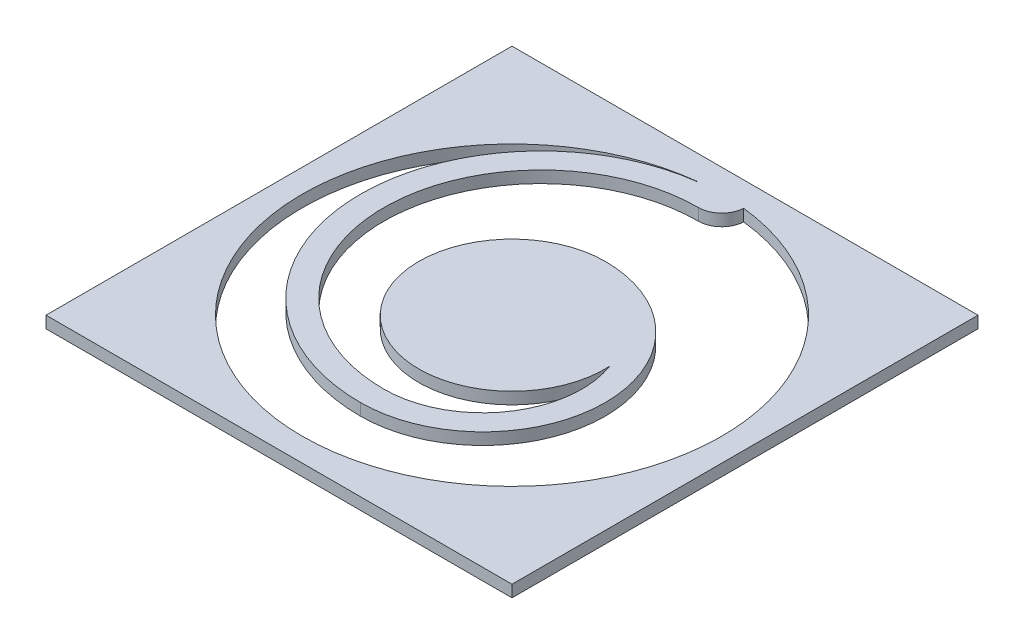
ISO-10303-21;
HEADER;
FILE_DESCRIPTION(('STEP AP214'),'2;1');
FILE_NAME('part.step','',(''),(''),'','','');
FILE_SCHEMA(('AUTOMOTIVE_DESIGN { 1 0 10303 214 1 1 1 1 }'));
ENDSEC;
DATA;
#1=APPLICATION_CONTEXT('core data for automotive mechanical design processes');
#2=APPLICATION_PROTOCOL_DEFINITION('international standard','automotive_design',2000,#1);
#3=PRODUCT_CONTEXT('',#1,'mechanical');
#4=PRODUCT('Part','Part','',(#3));
#5=PRODUCT_RELATED_PRODUCT_CATEGORY('part','',(#4));
#6=PRODUCT_DEFINITION_FORMATION('','',#4);
#7=PRODUCT_DEFINITION_CONTEXT('part definition',#1,'design');
#8=PRODUCT_DEFINITION('design','',#6,#7);
#9=PRODUCT_DEFINITION_SHAPE('','',#8);
#10=(LENGTH_UNIT() NAMED_UNIT(*) SI_UNIT(.MILLI.,.METRE.));
#11=(NAMED_UNIT(*) PLANE_ANGLE_UNIT() SI_UNIT($,.RADIAN.));
#12=(NAMED_UNIT(*) SI_UNIT($,.STERADIAN.) SOLID_ANGLE_UNIT());
#13=UNCERTAINTY_MEASURE_WITH_UNIT(LENGTH_MEASURE(1.E-05),#10,'distance_accuracy_value','');
#14=(GEOMETRIC_REPRESENTATION_CONTEXT(3) GLOBAL_UNCERTAINTY_ASSIGNED_CONTEXT((#13)) GLOBAL_UNIT_ASSIGNED_CONTEXT((#10,
#11,#12)) REPRESENTATION_CONTEXT('',''));
#15=CARTESIAN_POINT('',(0.,0.,0.));
#16=DIRECTION('',(0.,0.,1.));
#17=DIRECTION('',(1.,0.,0.));
#18=AXIS2_PLACEMENT_3D('',#15,#16,#17);
#19=CARTESIAN_POINT('',(0.,0.127,0.));
#20=DIRECTION('',(0.,0.,-1.));
#21=DIRECTION('',(-1.,0.,0.));
#22=AXIS2_PLACEMENT_3D('',#19,#20,#21);
#23=PLANE('',#22);
#24=DIRECTION('',(1.,0.,0.));
#25=VECTOR('',#24,1.);
#26=CARTESIAN_POINT('',(0.,0.,0.));
#27=LINE('',#26,#25);
#28=CARTESIAN_POINT('',(0.,0.,0.));
#29=VERTEX_POINT('',#28);
#30=CARTESIAN_POINT('',(5.,0.,0.));
#31=VERTEX_POINT('',#30);
#32=EDGE_CURVE('E199',#29,#31,#27,.T.);
#33=ORIENTED_EDGE('',*,*,#32,.T.);
#34=DIRECTION('',(0.,-1.,0.));
#35=VECTOR('',#34,1.);
#36=CARTESIAN_POINT('',(5.,0.127,0.));
#37=LINE('',#36,#35);
#38=CARTESIAN_POINT('',(5.,0.127,0.));
#39=VERTEX_POINT('',#38);
#40=EDGE_CURVE('E11',#39,#31,#37,.T.);
#41=ORIENTED_EDGE('',*,*,#40,.F.);
#42=DIRECTION('',(1.,0.,0.));
#43=VECTOR('',#42,1.);
#44=CARTESIAN_POINT('',(0.,0.127,0.));
#45=LINE('',#44,#43);
#46=CARTESIAN_POINT('',(0.,0.127,0.));
#47=VERTEX_POINT('',#46);
#48=EDGE_CURVE('E149',#47,#39,#45,.T.);
#49=ORIENTED_EDGE('',*,*,#48,.F.);
#50=DIRECTION('',(0.,-1.,0.));
#51=VECTOR('',#50,1.);
#52=CARTESIAN_POINT('',(0.,0.127,0.));
#53=LINE('',#52,#51);
#54=EDGE_CURVE('E65',#47,#29,#53,.T.);
#55=ORIENTED_EDGE('',*,*,#54,.T.);
#56=EDGE_LOOP('',(#33,#41,#49,#55));
#57=FACE_BOUND('',#56,.T.);
#58=ADVANCED_FACE('F45',(#57),#23,.F.);
#59=CARTESIAN_POINT('',(5.,0.127,0.));
#60=DIRECTION('',(-1.,0.,0.));
#61=DIRECTION('',(0.,0.,1.));
#62=AXIS2_PLACEMENT_3D('',#59,#60,#61);
#63=PLANE('',#62);
#64=DIRECTION('',(0.,0.,-1.));
#65=VECTOR('',#64,1.);
#66=CARTESIAN_POINT('',(5.,0.,0.));
#67=LINE('',#66,#65);
#68=CARTESIAN_POINT('',(5.,0.,-5.));
#69=VERTEX_POINT('',#68);
#70=EDGE_CURVE('E156',#31,#69,#67,.T.);
#71=ORIENTED_EDGE('',*,*,#70,.T.);
#72=DIRECTION('',(0.,-1.,0.));
#73=VECTOR('',#72,1.);
#74=CARTESIAN_POINT('',(5.,0.127,-5.));
#75=LINE('',#74,#73);
#76=CARTESIAN_POINT('',(5.,0.127,-5.));
#77=VERTEX_POINT('',#76);
#78=EDGE_CURVE('E56',#77,#69,#75,.T.);
#79=ORIENTED_EDGE('',*,*,#78,.F.);
#80=DIRECTION('',(0.,0.,-1.));
#81=VECTOR('',#80,1.);
#82=CARTESIAN_POINT('',(5.,0.127,0.));
#83=LINE('',#82,#81);
#84=EDGE_CURVE('E143',#39,#77,#83,.T.);
#85=ORIENTED_EDGE('',*,*,#84,.F.);
#86=ORIENTED_EDGE('',*,*,#40,.T.);
#87=EDGE_LOOP('',(#71,#79,#85,#86));
#88=FACE_BOUND('',#87,.T.);
#89=ADVANCED_FACE('F155',(#88),#63,.F.);
#90=CARTESIAN_POINT('',(0.,0.127,-5.));
#91=DIRECTION('',(0.,0.,-1.));
#92=DIRECTION('',(-1.,0.,0.));
#93=AXIS2_PLACEMENT_3D('',#90,#91,#92);
#94=PLANE('',#93);
#95=DIRECTION('',(1.,0.,0.));
#96=VECTOR('',#95,1.);
#97=CARTESIAN_POINT('',(0.,0.,-5.));
#98=LINE('',#97,#96);
#99=CARTESIAN_POINT('',(0.,0.,-5.));
#100=VERTEX_POINT('',#99);
#101=EDGE_CURVE('E204',#100,#69,#98,.T.);
#102=ORIENTED_EDGE('',*,*,#101,.F.);
#103=DIRECTION('',(0.,-1.,0.));
#104=VECTOR('',#103,1.);
#105=CARTESIAN_POINT('',(0.,0.127,-5.));
#106=LINE('',#105,#104);
#107=CARTESIAN_POINT('',(0.,0.127,-5.));
#108=VERTEX_POINT('',#107);
#109=EDGE_CURVE('E103',#108,#100,#106,.T.);
#110=ORIENTED_EDGE('',*,*,#109,.F.);
#111=DIRECTION('',(1.,0.,0.));
#112=VECTOR('',#111,1.);
#113=CARTESIAN_POINT('',(0.,0.127,-5.));
#114=LINE('',#113,#112);
#115=EDGE_CURVE('E148',#108,#77,#114,.T.);
#116=ORIENTED_EDGE('',*,*,#115,.T.);
#117=ORIENTED_EDGE('',*,*,#78,.T.);
#118=EDGE_LOOP('',(#102,#110,#116,#117));
#119=FACE_BOUND('',#118,.T.);
#120=ADVANCED_FACE('F161',(#119),#94,.T.);
#121=CARTESIAN_POINT('',(2.5,0.127,-2.5));
#122=DIRECTION('',(0.,-1.,0.));
#123=DIRECTION('',(0.,0.,-1.));
#124=AXIS2_PLACEMENT_3D('',#121,#122,#123);
#125=CYLINDRICAL_SURFACE('',#124,2.25);
#126=CARTESIAN_POINT('',(2.5,0.,-2.5));
#127=DIRECTION('',(0.,1.,0.));
#128=DIRECTION('',(0.,0.,1.));
#129=AXIS2_PLACEMENT_3D('',#126,#127,#128);
#130=CIRCLE('',#129,2.25);
#131=CARTESIAN_POINT('',(2.25038610061651,0.,-4.73611111111111));
#132=VERTEX_POINT('',#131);
#133=CARTESIAN_POINT('',(2.74961389938349,0.,-4.73611111111111));
#134=VERTEX_POINT('',#133);
#135=EDGE_CURVE('E170',#132,#134,#130,.T.);
#136=ORIENTED_EDGE('',*,*,#135,.F.);
#137=DIRECTION('',(0.,-1.,0.));
#138=VECTOR('',#137,1.);
#139=CARTESIAN_POINT('',(2.25038610061651,0.127,-4.73611111111111));
#140=LINE('',#139,#138);
#141=CARTESIAN_POINT('',(2.25038610061651,0.127,-4.73611111111111));
#142=VERTEX_POINT('',#141);
#143=EDGE_CURVE('E49',#142,#132,#140,.T.);
#144=ORIENTED_EDGE('',*,*,#143,.F.);
#145=CARTESIAN_POINT('',(2.5,0.127,-2.5));
#146=DIRECTION('',(0.,1.,0.));
#147=DIRECTION('',(0.,0.,1.));
#148=AXIS2_PLACEMENT_3D('',#145,#146,#147);
#149=CIRCLE('',#148,2.25);
#150=CARTESIAN_POINT('',(2.74961389938349,0.127,-4.73611111111111));
#151=VERTEX_POINT('',#150);
#152=EDGE_CURVE('E211',#142,#151,#149,.T.);
#153=ORIENTED_EDGE('',*,*,#152,.T.);
#154=DIRECTION('',(0.,-1.,0.));
#155=VECTOR('',#154,1.);
#156=CARTESIAN_POINT('',(2.74961389938349,0.127,-4.73611111111111));
#157=LINE('',#156,#155);
#158=EDGE_CURVE('E166',#151,#134,#157,.T.);
#159=ORIENTED_EDGE('',*,*,#158,.T.);
#160=EDGE_LOOP('',(#136,#144,#153,#159));
#161=FACE_BOUND('',#160,.T.);
#162=ADVANCED_FACE('F47',(#161),#125,.F.);
#163=CARTESIAN_POINT('',(2.5,0.127,-4.75));
#164=DIRECTION('',(0.,-1.,0.));
#165=DIRECTION('',(0.,0.,-1.));
#166=AXIS2_PLACEMENT_3D('',#163,#164,#165);
#167=CYLINDRICAL_SURFACE('',#166,0.249999999999999);
#168=CARTESIAN_POINT('',(2.5,0.,-4.75));
#169=DIRECTION('',(0.,1.,0.));
#170=DIRECTION('',(0.,0.,1.));
#171=AXIS2_PLACEMENT_3D('',#168,#169,#170);
#172=CIRCLE('',#171,0.249999999999999);
#173=CARTESIAN_POINT('',(2.25052083389907,0.,-4.73387096774194));
#174=VERTEX_POINT('',#173);
#175=EDGE_CURVE('E174',#132,#174,#172,.T.);
#176=ORIENTED_EDGE('',*,*,#175,.T.);
#177=DIRECTION('',(0.,-1.,0.));
#178=VECTOR('',#177,1.);
#179=CARTESIAN_POINT('',(2.25052083389907,0.127,-4.73387096774194));
#180=LINE('',#179,#178);
#181=CARTESIAN_POINT('',(2.25052083389907,0.127,-4.73387096774194));
#182=VERTEX_POINT('',#181);
#183=EDGE_CURVE('E234',#182,#174,#180,.T.);
#184=ORIENTED_EDGE('',*,*,#183,.F.);
#185=CARTESIAN_POINT('',(2.5,0.127,-4.75));
#186=DIRECTION('',(0.,1.,0.));
#187=DIRECTION('',(0.,0.,1.));
#188=AXIS2_PLACEMENT_3D('',#185,#186,#187);
#189=CIRCLE('',#188,0.249999999999999);
#190=EDGE_CURVE('E245',#142,#182,#189,.T.);
#191=ORIENTED_EDGE('',*,*,#190,.F.);
#192=ORIENTED_EDGE('',*,*,#143,.T.);
#193=EDGE_LOOP('',(#176,#184,#191,#192));
#194=FACE_BOUND('',#193,.T.);
#195=ADVANCED_FACE('F244',(#194),#167,.T.);
#196=CARTESIAN_POINT('',(2.5,0.127,-2.8125));
#197=DIRECTION('',(0.,-1.,0.));
#198=DIRECTION('',(0.,0.,-1.));
#199=AXIS2_PLACEMENT_3D('',#196,#197,#198);
#200=CYLINDRICAL_SURFACE('',#199,1.9375);
#201=CARTESIAN_POINT('',(2.5,0.,-2.8125));
#202=DIRECTION('',(0.,1.,0.));
#203=DIRECTION('',(0.,0.,1.));
#204=AXIS2_PLACEMENT_3D('',#201,#202,#203);
#205=CIRCLE('',#204,1.9375);
#206=CARTESIAN_POINT('',(2.5,0.,-0.875));
#207=VERTEX_POINT('',#206);
#208=EDGE_CURVE('E177',#174,#207,#205,.T.);
#209=ORIENTED_EDGE('',*,*,#208,.T.);
#210=DIRECTION('',(0.,-1.,0.));
#211=VECTOR('',#210,1.);
#212=CARTESIAN_POINT('',(2.5,0.127,-0.875));
#213=LINE('',#212,#211);
#214=CARTESIAN_POINT('',(2.5,0.127,-0.875));
#215=VERTEX_POINT('',#214);
#216=EDGE_CURVE('E231',#215,#207,#213,.T.);
#217=ORIENTED_EDGE('',*,*,#216,.F.);
#218=CARTESIAN_POINT('',(2.5,0.127,-2.8125));
#219=DIRECTION('',(0.,1.,0.));
#220=DIRECTION('',(0.,0.,1.));
#221=AXIS2_PLACEMENT_3D('',#218,#219,#220);
#222=CIRCLE('',#221,1.9375);
#223=EDGE_CURVE('E280',#182,#215,#222,.T.);
#224=ORIENTED_EDGE('',*,*,#223,.F.);
#225=ORIENTED_EDGE('',*,*,#183,.T.);
#226=EDGE_LOOP('',(#209,#217,#224,#225));
#227=FACE_BOUND('',#226,.T.);
#228=ADVANCED_FACE('F279',(#227),#200,.T.);
#229=CARTESIAN_POINT('',(2.5,0.127,-2.1875));
#230=DIRECTION('',(0.,-1.,0.));
#231=DIRECTION('',(0.,0.,-1.));
#232=AXIS2_PLACEMENT_3D('',#229,#230,#231);
#233=CYLINDRICAL_SURFACE('',#232,1.3125);
#234=CARTESIAN_POINT('',(2.5,0.,-2.1875));
#235=DIRECTION('',(0.,1.,0.));
#236=DIRECTION('',(0.,0.,1.));
#237=AXIS2_PLACEMENT_3D('',#234,#235,#236);
#238=CIRCLE('',#237,1.3125);
#239=CARTESIAN_POINT('',(2.5,0.,-3.5));
#240=VERTEX_POINT('',#239);
#241=EDGE_CURVE('E180',#207,#240,#238,.T.);
#242=ORIENTED_EDGE('',*,*,#241,.T.);
#243=DIRECTION('',(0.,-1.,0.));
#244=VECTOR('',#243,1.);
#245=CARTESIAN_POINT('',(2.5,0.127,-3.5));
#246=LINE('',#245,#244);
#247=CARTESIAN_POINT('',(2.5,0.127,-3.5));
#248=VERTEX_POINT('',#247);
#249=EDGE_CURVE('E227',#248,#240,#246,.T.);
#250=ORIENTED_EDGE('',*,*,#249,.F.);
#251=CARTESIAN_POINT('',(2.5,0.127,-2.1875));
#252=DIRECTION('',(0.,1.,0.));
#253=DIRECTION('',(0.,0.,1.));
#254=AXIS2_PLACEMENT_3D('',#251,#252,#253);
#255=CIRCLE('',#254,1.3125);
#256=EDGE_CURVE('E277',#215,#248,#255,.T.);
#257=ORIENTED_EDGE('',*,*,#256,.F.);
#258=ORIENTED_EDGE('',*,*,#216,.T.);
#259=EDGE_LOOP('',(#242,#250,#257,#258));
#260=FACE_BOUND('',#259,.T.);
#261=ADVANCED_FACE('F276',(#260),#233,.T.);
#262=CARTESIAN_POINT('',(2.5,0.127,-2.5));
#263=DIRECTION('',(0.,-1.,0.));
#264=DIRECTION('',(0.,0.,-1.));
#265=AXIS2_PLACEMENT_3D('',#262,#263,#264);
#266=CYLINDRICAL_SURFACE('',#265,1.);
#267=CARTESIAN_POINT('',(2.5,0.,-2.5));
#268=DIRECTION('',(0.,1.,0.));
#269=DIRECTION('',(0.,0.,1.));
#270=AXIS2_PLACEMENT_3D('',#267,#268,#269);
#271=CIRCLE('',#270,1.);
#272=CARTESIAN_POINT('',(3.49874921777191,0.,-2.55));
#273=VERTEX_POINT('',#272);
#274=EDGE_CURVE('E183',#240,#273,#271,.T.);
#275=ORIENTED_EDGE('',*,*,#274,.T.);
#276=DIRECTION('',(0.,-1.,0.));
#277=VECTOR('',#276,1.);
#278=CARTESIAN_POINT('',(3.49874921777191,0.127,-2.55));
#279=LINE('',#278,#277);
#280=CARTESIAN_POINT('',(3.49874921777191,0.127,-2.55));
#281=VERTEX_POINT('',#280);
#282=EDGE_CURVE('E224',#281,#273,#279,.T.);
#283=ORIENTED_EDGE('',*,*,#282,.F.);
#284=CARTESIAN_POINT('',(2.5,0.127,-2.5));
#285=DIRECTION('',(0.,1.,0.));
#286=DIRECTION('',(0.,0.,1.));
#287=AXIS2_PLACEMENT_3D('',#284,#285,#286);
#288=CIRCLE('',#287,1.);
#289=EDGE_CURVE('E273',#248,#281,#288,.T.);
#290=ORIENTED_EDGE('',*,*,#289,.F.);
#291=ORIENTED_EDGE('',*,*,#249,.T.);
#292=EDGE_LOOP('',(#275,#283,#290,#291));
#293=FACE_BOUND('',#292,.T.);
#294=ADVANCED_FACE('F270',(#293),#266,.T.);
#295=CARTESIAN_POINT('',(2.5,0.127,-2.1875));
#296=DIRECTION('',(0.,-1.,0.));
#297=DIRECTION('',(0.,0.,-1.));
#298=AXIS2_PLACEMENT_3D('',#295,#296,#297);
#299=CYLINDRICAL_SURFACE('',#298,1.0625);
#300=CARTESIAN_POINT('',(2.5,0.,-2.1875));
#301=DIRECTION('',(0.,1.,0.));
#302=DIRECTION('',(0.,0.,1.));
#303=AXIS2_PLACEMENT_3D('',#300,#301,#302);
#304=CIRCLE('',#303,1.0625);
#305=CARTESIAN_POINT('',(2.5,0.,-1.125));
#306=VERTEX_POINT('',#305);
#307=EDGE_CURVE('E187',#306,#273,#304,.T.);
#308=ORIENTED_EDGE('',*,*,#307,.F.);
#309=DIRECTION('',(0.,-1.,0.));
#310=VECTOR('',#309,1.);
#311=CARTESIAN_POINT('',(2.5,0.127,-1.125));
#312=LINE('',#311,#310);
#313=CARTESIAN_POINT('',(2.5,0.127,-1.125));
#314=VERTEX_POINT('',#313);
#315=EDGE_CURVE('E221',#314,#306,#312,.T.);
#316=ORIENTED_EDGE('',*,*,#315,.F.);
#317=CARTESIAN_POINT('',(2.5,0.127,-2.1875));
#318=DIRECTION('',(0.,1.,0.));
#319=DIRECTION('',(0.,0.,1.));
#320=AXIS2_PLACEMENT_3D('',#317,#318,#319);
#321=CIRCLE('',#320,1.0625);
#322=EDGE_CURVE('E292',#314,#281,#321,.T.);
#323=ORIENTED_EDGE('',*,*,#322,.T.);
#324=ORIENTED_EDGE('',*,*,#282,.T.);
#325=EDGE_LOOP('',(#308,#316,#323,#324));
#326=FACE_BOUND('',#325,.T.);
#327=ADVANCED_FACE('F266',(#326),#299,.F.);
#328=CARTESIAN_POINT('',(2.5,0.127,-2.8125));
#329=DIRECTION('',(0.,-1.,0.));
#330=DIRECTION('',(0.,0.,-1.));
#331=AXIS2_PLACEMENT_3D('',#328,#329,#330);
#332=CYLINDRICAL_SURFACE('',#331,1.6875);
#333=CARTESIAN_POINT('',(2.5,0.,-2.8125));
#334=DIRECTION('',(0.,1.,0.));
#335=DIRECTION('',(0.,0.,1.));
#336=AXIS2_PLACEMENT_3D('',#333,#334,#335);
#337=CIRCLE('',#336,1.6875);
#338=CARTESIAN_POINT('',(2.5,0.,-4.5));
#339=VERTEX_POINT('',#338);
#340=EDGE_CURVE('E191',#339,#306,#337,.T.);
#341=ORIENTED_EDGE('',*,*,#340,.F.);
#342=DIRECTION('',(0.,-1.,0.));
#343=VECTOR('',#342,1.);
#344=CARTESIAN_POINT('',(2.5,0.127,-4.5));
#345=LINE('',#344,#343);
#346=CARTESIAN_POINT('',(2.5,0.127,-4.5));
#347=VERTEX_POINT('',#346);
#348=EDGE_CURVE('E218',#347,#339,#345,.T.);
#349=ORIENTED_EDGE('',*,*,#348,.F.);
#350=CARTESIAN_POINT('',(2.5,0.127,-2.8125));
#351=DIRECTION('',(0.,1.,0.));
#352=DIRECTION('',(0.,0.,1.));
#353=AXIS2_PLACEMENT_3D('',#350,#351,#352);
#354=CIRCLE('',#353,1.6875);
#355=EDGE_CURVE('E262',#347,#314,#354,.T.);
#356=ORIENTED_EDGE('',*,*,#355,.T.);
#357=ORIENTED_EDGE('',*,*,#315,.T.);
#358=EDGE_LOOP('',(#341,#349,#356,#357));
#359=FACE_BOUND('',#358,.T.);
#360=ADVANCED_FACE('F258',(#359),#332,.F.);
#361=CARTESIAN_POINT('',(2.5,0.127,-4.75));
#362=DIRECTION('',(0.,-1.,0.));
#363=DIRECTION('',(0.,0.,-1.));
#364=AXIS2_PLACEMENT_3D('',#361,#362,#363);
#365=CYLINDRICAL_SURFACE('',#364,0.250000000000001);
#366=CARTESIAN_POINT('',(2.5,0.,-4.75));
#367=DIRECTION('',(0.,1.,0.));
#368=DIRECTION('',(0.,0.,1.));
#369=AXIS2_PLACEMENT_3D('',#366,#367,#368);
#370=CIRCLE('',#369,0.250000000000001);
#371=EDGE_CURVE('E195',#339,#134,#370,.T.);
#372=ORIENTED_EDGE('',*,*,#371,.T.);
#373=ORIENTED_EDGE('',*,*,#158,.F.);
#374=CARTESIAN_POINT('',(2.5,0.127,-4.75));
#375=DIRECTION('',(0.,1.,0.));
#376=DIRECTION('',(0.,0.,1.));
#377=AXIS2_PLACEMENT_3D('',#374,#375,#376);
#378=CIRCLE('',#377,0.250000000000001);
#379=EDGE_CURVE('E297',#347,#151,#378,.T.);
#380=ORIENTED_EDGE('',*,*,#379,.F.);
#381=ORIENTED_EDGE('',*,*,#348,.T.);
#382=EDGE_LOOP('',(#372,#373,#380,#381));
#383=FACE_BOUND('',#382,.T.);
#384=ADVANCED_FACE('F255',(#383),#365,.T.);
#385=CARTESIAN_POINT('',(0.,0.127,0.));
#386=DIRECTION('',(-1.,0.,0.));
#387=DIRECTION('',(0.,0.,1.));
#388=AXIS2_PLACEMENT_3D('',#385,#386,#387);
#389=PLANE('',#388);
#390=DIRECTION('',(0.,0.,-1.));
#391=VECTOR('',#390,1.);
#392=CARTESIAN_POINT('',(0.,0.,0.));
#393=LINE('',#392,#391);
#394=EDGE_CURVE('E207',#29,#100,#393,.T.);
#395=ORIENTED_EDGE('',*,*,#394,.F.);
#396=ORIENTED_EDGE('',*,*,#54,.F.);
#397=DIRECTION('',(0.,0.,-1.));
#398=VECTOR('',#397,1.);
#399=CARTESIAN_POINT('',(0.,0.127,0.));
#400=LINE('',#399,#398);
#401=EDGE_CURVE('E163',#47,#108,#400,.T.);
#402=ORIENTED_EDGE('',*,*,#401,.T.);
#403=ORIENTED_EDGE('',*,*,#109,.T.);
#404=EDGE_LOOP('',(#395,#396,#402,#403));
#405=FACE_BOUND('',#404,.T.);
#406=ADVANCED_FACE('F302',(#405),#389,.T.);
#407=CARTESIAN_POINT('',(0.,0.127,0.));
#408=DIRECTION('',(0.,1.,0.));
#409=DIRECTION('',(0.,0.,1.));
#410=AXIS2_PLACEMENT_3D('',#407,#408,#409);
#411=PLANE('',#410);
#412=ORIENTED_EDGE('',*,*,#152,.F.);
#413=ORIENTED_EDGE('',*,*,#190,.T.);
#414=ORIENTED_EDGE('',*,*,#223,.T.);
#415=ORIENTED_EDGE('',*,*,#256,.T.);
#416=ORIENTED_EDGE('',*,*,#289,.T.);
#417=ORIENTED_EDGE('',*,*,#322,.F.);
#418=ORIENTED_EDGE('',*,*,#355,.F.);
#419=ORIENTED_EDGE('',*,*,#379,.T.);
#420=EDGE_LOOP('',(#412,#413,#414,#415,#416,#417,#418,#419));
#421=FACE_BOUND('',#420,.T.);
#422=ORIENTED_EDGE('',*,*,#48,.T.);
#423=ORIENTED_EDGE('',*,*,#84,.T.);
#424=ORIENTED_EDGE('',*,*,#115,.F.);
#425=ORIENTED_EDGE('',*,*,#401,.F.);
#426=EDGE_LOOP('',(#422,#423,#424,#425));
#427=FACE_BOUND('',#426,.T.);
#428=ADVANCED_FACE('F145',(#421,#427),#411,.T.);
#429=CARTESIAN_POINT('',(0.,0.,0.));
#430=DIRECTION('',(0.,1.,0.));
#431=DIRECTION('',(0.,0.,1.));
#432=AXIS2_PLACEMENT_3D('',#429,#430,#431);
#433=PLANE('',#432);
#434=ORIENTED_EDGE('',*,*,#135,.T.);
#435=ORIENTED_EDGE('',*,*,#371,.F.);
#436=ORIENTED_EDGE('',*,*,#340,.T.);
#437=ORIENTED_EDGE('',*,*,#307,.T.);
#438=ORIENTED_EDGE('',*,*,#274,.F.);
#439=ORIENTED_EDGE('',*,*,#241,.F.);
#440=ORIENTED_EDGE('',*,*,#208,.F.);
#441=ORIENTED_EDGE('',*,*,#175,.F.);
#442=EDGE_LOOP('',(#434,#435,#436,#437,#438,#439,#440,#441));
#443=FACE_BOUND('',#442,.T.);
#444=ORIENTED_EDGE('',*,*,#32,.F.);
#445=ORIENTED_EDGE('',*,*,#394,.T.);
#446=ORIENTED_EDGE('',*,*,#101,.T.);
#447=ORIENTED_EDGE('',*,*,#70,.F.);
#448=EDGE_LOOP('',(#444,#445,#446,#447));
#449=FACE_BOUND('',#448,.T.);
#450=ADVANCED_FACE('F248',(#443,#449),#433,.F.);
#451=CLOSED_SHELL('',(#58,#89,#120,#162,#195,#228,#261,#294,#327,#360,#384,#406,#428,#450));
#452=MANIFOLD_SOLID_BREP('B2',#451);
#453=ADVANCED_BREP_SHAPE_REPRESENTATION('',(#18,#452),#14);
#454=SHAPE_DEFINITION_REPRESENTATION(#9,#453);
ENDSEC;
END-ISO-10303-21;
